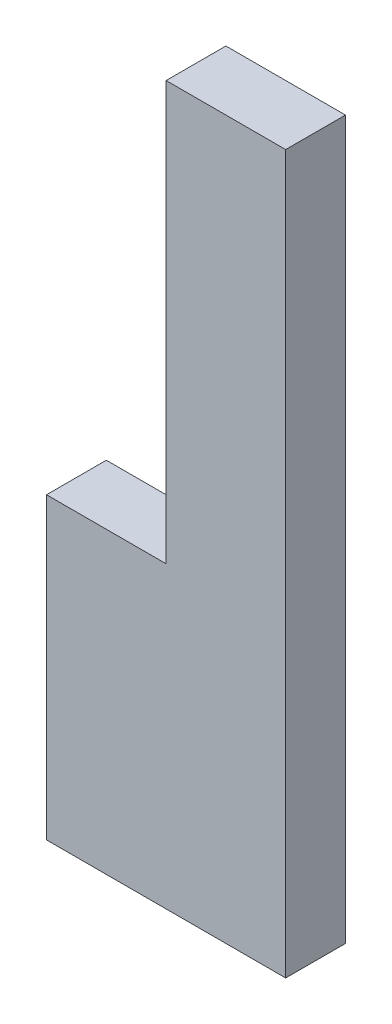
ISO-10303-21;
HEADER;
FILE_DESCRIPTION(('STEP AP214'),'2;1');
FILE_NAME('part.step','',(''),(''),'','','');
FILE_SCHEMA(('AUTOMOTIVE_DESIGN { 1 0 10303 214 1 1 1 1 }'));
ENDSEC;
DATA;
#1=APPLICATION_CONTEXT('core data for automotive mechanical design processes');
#2=APPLICATION_PROTOCOL_DEFINITION('international standard','automotive_design',2000,#1);
#3=PRODUCT_CONTEXT('',#1,'mechanical');
#4=PRODUCT('Part','Part','',(#3));
#5=PRODUCT_RELATED_PRODUCT_CATEGORY('part','',(#4));
#6=PRODUCT_DEFINITION_FORMATION('','',#4);
#7=PRODUCT_DEFINITION_CONTEXT('part definition',#1,'design');
#8=PRODUCT_DEFINITION('design','',#6,#7);
#9=PRODUCT_DEFINITION_SHAPE('','',#8);
#10=(LENGTH_UNIT() NAMED_UNIT(*) SI_UNIT(.MILLI.,.METRE.));
#11=(NAMED_UNIT(*) PLANE_ANGLE_UNIT() SI_UNIT($,.RADIAN.));
#12=(NAMED_UNIT(*) SI_UNIT($,.STERADIAN.) SOLID_ANGLE_UNIT());
#13=UNCERTAINTY_MEASURE_WITH_UNIT(LENGTH_MEASURE(1.E-05),#10,'distance_accuracy_value','');
#14=(GEOMETRIC_REPRESENTATION_CONTEXT(3) GLOBAL_UNCERTAINTY_ASSIGNED_CONTEXT((#13)) GLOBAL_UNIT_ASSIGNED_CONTEXT((#10,
#11,#12)) REPRESENTATION_CONTEXT('',''));
#15=CARTESIAN_POINT('',(0.,0.,0.));
#16=DIRECTION('',(0.,0.,1.));
#17=DIRECTION('',(1.,0.,0.));
#18=AXIS2_PLACEMENT_3D('',#15,#16,#17);
#19=CARTESIAN_POINT('',(-4.,0.,1.));
#20=DIRECTION('',(0.,1.,0.));
#21=DIRECTION('',(0.,0.,1.));
#22=AXIS2_PLACEMENT_3D('',#19,#20,#21);
#23=PLANE('',#22);
#24=DIRECTION('',(1.,0.,0.));
#25=VECTOR('',#24,1.);
#26=CARTESIAN_POINT('',(-4.,0.,0.));
#27=LINE('',#26,#25);
#28=CARTESIAN_POINT('',(-4.,0.,0.));
#29=VERTEX_POINT('',#28);
#30=CARTESIAN_POINT('',(0.,0.,0.));
#31=VERTEX_POINT('',#30);
#32=EDGE_CURVE('E115',#29,#31,#27,.T.);
#33=ORIENTED_EDGE('',*,*,#32,.T.);
#34=DIRECTION('',(0.,0.,-1.));
#35=VECTOR('',#34,1.);
#36=CARTESIAN_POINT('',(0.,0.,1.));
#37=LINE('',#36,#35);
#38=CARTESIAN_POINT('',(0.,0.,1.));
#39=VERTEX_POINT('',#38);
#40=EDGE_CURVE('E11',#39,#31,#37,.T.);
#41=ORIENTED_EDGE('',*,*,#40,.F.);
#42=DIRECTION('',(1.,0.,0.));
#43=VECTOR('',#42,1.);
#44=CARTESIAN_POINT('',(-4.,0.,1.));
#45=LINE('',#44,#43);
#46=CARTESIAN_POINT('',(-4.,0.,1.));
#47=VERTEX_POINT('',#46);
#48=EDGE_CURVE('E125',#47,#39,#45,.T.);
#49=ORIENTED_EDGE('',*,*,#48,.F.);
#50=DIRECTION('',(0.,0.,-1.));
#51=VECTOR('',#50,1.);
#52=CARTESIAN_POINT('',(-4.,0.,1.));
#53=LINE('',#52,#51);
#54=EDGE_CURVE('E111',#47,#29,#53,.T.);
#55=ORIENTED_EDGE('',*,*,#54,.T.);
#56=EDGE_LOOP('',(#33,#41,#49,#55));
#57=FACE_BOUND('',#56,.T.);
#58=ADVANCED_FACE('F31',(#57),#23,.F.);
#59=CARTESIAN_POINT('',(0.,0.,1.));
#60=DIRECTION('',(-1.,0.,0.));
#61=DIRECTION('',(0.,0.,1.));
#62=AXIS2_PLACEMENT_3D('',#59,#60,#61);
#63=PLANE('',#62);
#64=DIRECTION('',(0.,1.,0.));
#65=VECTOR('',#64,1.);
#66=CARTESIAN_POINT('',(0.,0.,0.));
#67=LINE('',#66,#65);
#68=CARTESIAN_POINT('',(0.,12.,0.));
#69=VERTEX_POINT('',#68);
#70=EDGE_CURVE('E118',#31,#69,#67,.T.);
#71=ORIENTED_EDGE('',*,*,#70,.T.);
#72=DIRECTION('',(0.,0.,-1.));
#73=VECTOR('',#72,1.);
#74=CARTESIAN_POINT('',(0.,12.,1.));
#75=LINE('',#74,#73);
#76=CARTESIAN_POINT('',(0.,12.,1.));
#77=VERTEX_POINT('',#76);
#78=EDGE_CURVE('E39',#77,#69,#75,.T.);
#79=ORIENTED_EDGE('',*,*,#78,.F.);
#80=DIRECTION('',(0.,1.,0.));
#81=VECTOR('',#80,1.);
#82=CARTESIAN_POINT('',(0.,0.,1.));
#83=LINE('',#82,#81);
#84=EDGE_CURVE('E84',#39,#77,#83,.T.);
#85=ORIENTED_EDGE('',*,*,#84,.F.);
#86=ORIENTED_EDGE('',*,*,#40,.T.);
#87=EDGE_LOOP('',(#71,#79,#85,#86));
#88=FACE_BOUND('',#87,.T.);
#89=ADVANCED_FACE('F149',(#88),#63,.F.);
#90=CARTESIAN_POINT('',(0.,12.,1.));
#91=DIRECTION('',(0.,-1.,0.));
#92=DIRECTION('',(0.,0.,-1.));
#93=AXIS2_PLACEMENT_3D('',#90,#91,#92);
#94=PLANE('',#93);
#95=DIRECTION('',(-1.,0.,0.));
#96=VECTOR('',#95,1.);
#97=CARTESIAN_POINT('',(0.,12.,0.));
#98=LINE('',#97,#96);
#99=CARTESIAN_POINT('',(-2.,12.,0.));
#100=VERTEX_POINT('',#99);
#101=EDGE_CURVE('E120',#69,#100,#98,.T.);
#102=ORIENTED_EDGE('',*,*,#101,.T.);
#103=DIRECTION('',(0.,0.,-1.));
#104=VECTOR('',#103,1.);
#105=CARTESIAN_POINT('',(-2.,12.,1.));
#106=LINE('',#105,#104);
#107=CARTESIAN_POINT('',(-2.,12.,1.));
#108=VERTEX_POINT('',#107);
#109=EDGE_CURVE('E106',#108,#100,#106,.T.);
#110=ORIENTED_EDGE('',*,*,#109,.F.);
#111=DIRECTION('',(-1.,0.,0.));
#112=VECTOR('',#111,1.);
#113=CARTESIAN_POINT('',(0.,12.,1.));
#114=LINE('',#113,#112);
#115=EDGE_CURVE('E97',#77,#108,#114,.T.);
#116=ORIENTED_EDGE('',*,*,#115,.F.);
#117=ORIENTED_EDGE('',*,*,#78,.T.);
#118=EDGE_LOOP('',(#102,#110,#116,#117));
#119=FACE_BOUND('',#118,.T.);
#120=ADVANCED_FACE('F131',(#119),#94,.F.);
#121=CARTESIAN_POINT('',(-2.,12.,1.));
#122=DIRECTION('',(1.,0.,0.));
#123=DIRECTION('',(0.,1.,0.));
#124=AXIS2_PLACEMENT_3D('',#121,#122,#123);
#125=PLANE('',#124);
#126=DIRECTION('',(0.,-1.,0.));
#127=VECTOR('',#126,1.);
#128=CARTESIAN_POINT('',(-2.,12.,0.));
#129=LINE('',#128,#127);
#130=CARTESIAN_POINT('',(-2.,5.,0.));
#131=VERTEX_POINT('',#130);
#132=EDGE_CURVE('E105',#100,#131,#129,.T.);
#133=ORIENTED_EDGE('',*,*,#132,.T.);
#134=DIRECTION('',(0.,0.,-1.));
#135=VECTOR('',#134,1.);
#136=CARTESIAN_POINT('',(-2.,5.,1.));
#137=LINE('',#136,#135);
#138=CARTESIAN_POINT('',(-2.,5.,1.));
#139=VERTEX_POINT('',#138);
#140=EDGE_CURVE('E102',#139,#131,#137,.T.);
#141=ORIENTED_EDGE('',*,*,#140,.F.);
#142=DIRECTION('',(0.,-1.,0.));
#143=VECTOR('',#142,1.);
#144=CARTESIAN_POINT('',(-2.,12.,1.));
#145=LINE('',#144,#143);
#146=EDGE_CURVE('E91',#108,#139,#145,.T.);
#147=ORIENTED_EDGE('',*,*,#146,.F.);
#148=ORIENTED_EDGE('',*,*,#109,.T.);
#149=EDGE_LOOP('',(#133,#141,#147,#148));
#150=FACE_BOUND('',#149,.T.);
#151=ADVANCED_FACE('F103',(#150),#125,.F.);
#152=CARTESIAN_POINT('',(-2.,5.,1.));
#153=DIRECTION('',(0.,-1.,0.));
#154=DIRECTION('',(0.,0.,-1.));
#155=AXIS2_PLACEMENT_3D('',#152,#153,#154);
#156=PLANE('',#155);
#157=DIRECTION('',(-1.,0.,0.));
#158=VECTOR('',#157,1.);
#159=CARTESIAN_POINT('',(-2.,5.,0.));
#160=LINE('',#159,#158);
#161=CARTESIAN_POINT('',(-4.,5.,0.));
#162=VERTEX_POINT('',#161);
#163=EDGE_CURVE('E70',#131,#162,#160,.T.);
#164=ORIENTED_EDGE('',*,*,#163,.T.);
#165=DIRECTION('',(0.,0.,-1.));
#166=VECTOR('',#165,1.);
#167=CARTESIAN_POINT('',(-4.,5.,1.));
#168=LINE('',#167,#166);
#169=CARTESIAN_POINT('',(-4.,5.,1.));
#170=VERTEX_POINT('',#169);
#171=EDGE_CURVE('E107',#170,#162,#168,.T.);
#172=ORIENTED_EDGE('',*,*,#171,.F.);
#173=DIRECTION('',(-1.,0.,0.));
#174=VECTOR('',#173,1.);
#175=CARTESIAN_POINT('',(-2.,5.,1.));
#176=LINE('',#175,#174);
#177=EDGE_CURVE('E95',#139,#170,#176,.T.);
#178=ORIENTED_EDGE('',*,*,#177,.F.);
#179=ORIENTED_EDGE('',*,*,#140,.T.);
#180=EDGE_LOOP('',(#164,#172,#178,#179));
#181=FACE_BOUND('',#180,.T.);
#182=ADVANCED_FACE('F109',(#181),#156,.F.);
#183=CARTESIAN_POINT('',(-4.,5.,1.));
#184=DIRECTION('',(1.,0.,0.));
#185=DIRECTION('',(0.,1.,0.));
#186=AXIS2_PLACEMENT_3D('',#183,#184,#185);
#187=PLANE('',#186);
#188=DIRECTION('',(0.,-1.,0.));
#189=VECTOR('',#188,1.);
#190=CARTESIAN_POINT('',(-4.,5.,0.));
#191=LINE('',#190,#189);
#192=EDGE_CURVE('E76',#162,#29,#191,.T.);
#193=ORIENTED_EDGE('',*,*,#192,.T.);
#194=ORIENTED_EDGE('',*,*,#54,.F.);
#195=DIRECTION('',(0.,-1.,0.));
#196=VECTOR('',#195,1.);
#197=CARTESIAN_POINT('',(-4.,5.,1.));
#198=LINE('',#197,#196);
#199=EDGE_CURVE('E47',#170,#47,#198,.T.);
#200=ORIENTED_EDGE('',*,*,#199,.F.);
#201=ORIENTED_EDGE('',*,*,#171,.T.);
#202=EDGE_LOOP('',(#193,#194,#200,#201));
#203=FACE_BOUND('',#202,.T.);
#204=ADVANCED_FACE('F138',(#203),#187,.F.);
#205=CARTESIAN_POINT('',(0.,0.,1.));
#206=DIRECTION('',(0.,0.,1.));
#207=DIRECTION('',(1.,0.,0.));
#208=AXIS2_PLACEMENT_3D('',#205,#206,#207);
#209=PLANE('',#208);
#210=ORIENTED_EDGE('',*,*,#48,.T.);
#211=ORIENTED_EDGE('',*,*,#84,.T.);
#212=ORIENTED_EDGE('',*,*,#115,.T.);
#213=ORIENTED_EDGE('',*,*,#146,.T.);
#214=ORIENTED_EDGE('',*,*,#177,.T.);
#215=ORIENTED_EDGE('',*,*,#199,.T.);
#216=EDGE_LOOP('',(#210,#211,#212,#213,#214,#215));
#217=FACE_BOUND('',#216,.T.);
#218=ADVANCED_FACE('F93',(#217),#209,.T.);
#219=CARTESIAN_POINT('',(0.,0.,0.));
#220=DIRECTION('',(0.,0.,1.));
#221=DIRECTION('',(1.,0.,0.));
#222=AXIS2_PLACEMENT_3D('',#219,#220,#221);
#223=PLANE('',#222);
#224=ORIENTED_EDGE('',*,*,#32,.F.);
#225=ORIENTED_EDGE('',*,*,#192,.F.);
#226=ORIENTED_EDGE('',*,*,#163,.F.);
#227=ORIENTED_EDGE('',*,*,#132,.F.);
#228=ORIENTED_EDGE('',*,*,#101,.F.);
#229=ORIENTED_EDGE('',*,*,#70,.F.);
#230=EDGE_LOOP('',(#224,#225,#226,#227,#228,#229));
#231=FACE_BOUND('',#230,.T.);
#232=ADVANCED_FACE('F134',(#231),#223,.F.);
#233=CLOSED_SHELL('',(#58,#89,#120,#151,#182,#204,#218,#232));
#234=MANIFOLD_SOLID_BREP('B2',#233);
#235=ADVANCED_BREP_SHAPE_REPRESENTATION('',(#18,#234),#14);
#236=SHAPE_DEFINITION_REPRESENTATION(#9,#235);
ENDSEC;
END-ISO-10303-21;
